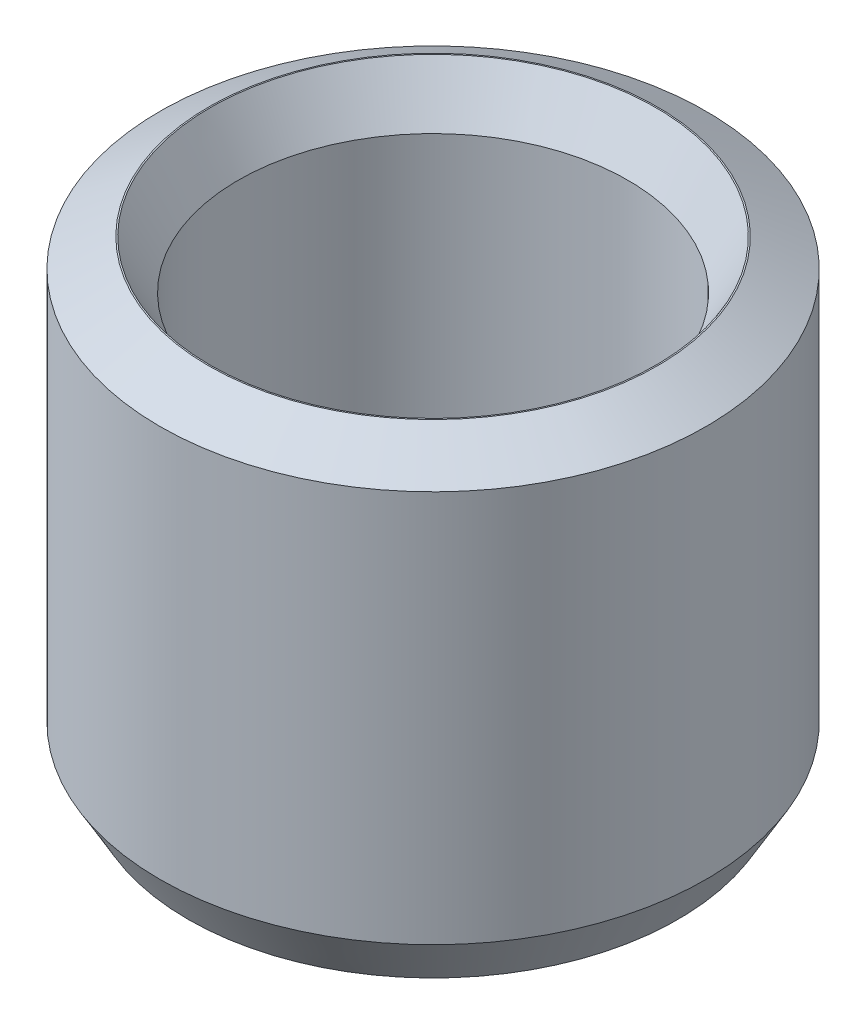
ISO-10303-21;
HEADER;
FILE_DESCRIPTION(('STEP AP214'),'2;1');
FILE_NAME('part.step','',(''),(''),'','','');
FILE_SCHEMA(('AUTOMOTIVE_DESIGN { 1 0 10303 214 1 1 1 1 }'));
ENDSEC;
DATA;
#1=APPLICATION_CONTEXT('core data for automotive mechanical design processes');
#2=APPLICATION_PROTOCOL_DEFINITION('international standard','automotive_design',2000,#1);
#3=PRODUCT_CONTEXT('',#1,'mechanical');
#4=PRODUCT('Part','Part','',(#3));
#5=PRODUCT_RELATED_PRODUCT_CATEGORY('part','',(#4));
#6=PRODUCT_DEFINITION_FORMATION('','',#4);
#7=PRODUCT_DEFINITION_CONTEXT('part definition',#1,'design');
#8=PRODUCT_DEFINITION('design','',#6,#7);
#9=PRODUCT_DEFINITION_SHAPE('','',#8);
#10=(LENGTH_UNIT() NAMED_UNIT(*) SI_UNIT(.MILLI.,.METRE.));
#11=(NAMED_UNIT(*) PLANE_ANGLE_UNIT() SI_UNIT($,.RADIAN.));
#12=(NAMED_UNIT(*) SI_UNIT($,.STERADIAN.) SOLID_ANGLE_UNIT());
#13=UNCERTAINTY_MEASURE_WITH_UNIT(LENGTH_MEASURE(1.E-05),#10,'distance_accuracy_value','');
#14=(GEOMETRIC_REPRESENTATION_CONTEXT(3) GLOBAL_UNCERTAINTY_ASSIGNED_CONTEXT((#13)) GLOBAL_UNIT_ASSIGNED_CONTEXT((#10,
#11,#12)) REPRESENTATION_CONTEXT('',''));
#15=CARTESIAN_POINT('',(0.,0.,0.));
#16=DIRECTION('',(0.,0.,1.));
#17=DIRECTION('',(1.,0.,0.));
#18=AXIS2_PLACEMENT_3D('',#15,#16,#17);
#19=CARTESIAN_POINT('',(0.,17.1783926277646,0.));
#20=DIRECTION('',(0.,-1.,0.));
#21=DIRECTION('',(0.,0.,-1.));
#22=AXIS2_PLACEMENT_3D('',#19,#20,#21);
#23=CYLINDRICAL_SURFACE('',#22,10.);
#24=CARTESIAN_POINT('',(0.,1.78422582062827,0.));
#25=DIRECTION('',(0.,1.,0.));
#26=DIRECTION('',(0.,0.,1.));
#27=AXIS2_PLACEMENT_3D('',#24,#25,#26);
#28=CIRCLE('',#27,10.);
#29=CARTESIAN_POINT('',(0.,1.78422582062827,10.));
#30=VERTEX_POINT('',#29);
#31=EDGE_CURVE('E10',#30,#30,#28,.T.);
#32=ORIENTED_EDGE('',*,*,#31,.T.);
#33=EDGE_LOOP('',(#32));
#34=FACE_BOUND('',#33,.T.);
#35=CARTESIAN_POINT('',(0.,16.1482693699298,0.));
#36=DIRECTION('',(0.,1.,0.));
#37=DIRECTION('',(0.,0.,1.));
#38=AXIS2_PLACEMENT_3D('',#35,#36,#37);
#39=CIRCLE('',#38,10.);
#40=CARTESIAN_POINT('',(0.,16.1482693699298,10.));
#41=VERTEX_POINT('',#40);
#42=EDGE_CURVE('E50',#41,#41,#39,.F.);
#43=ORIENTED_EDGE('',*,*,#42,.T.);
#44=EDGE_LOOP('',(#43));
#45=FACE_BOUND('',#44,.T.);
#46=ADVANCED_FACE('F39',(#34,#45),#23,.T.);
#47=CARTESIAN_POINT('',(0.,17.1783926277646,0.));
#48=DIRECTION('',(0.,1.,0.));
#49=DIRECTION('',(0.,0.,1.));
#50=AXIS2_PLACEMENT_3D('',#47,#48,#49);
#51=PLANE('',#50);
#52=CARTESIAN_POINT('',(0.,17.1783926277646,0.));
#53=DIRECTION('',(0.,1.,0.));
#54=DIRECTION('',(0.,0.,1.));
#55=AXIS2_PLACEMENT_3D('',#52,#53,#54);
#56=CIRCLE('',#55,8.16568415285992);
#57=CARTESIAN_POINT('',(0.,17.1783926277646,8.16568415285992));
#58=VERTEX_POINT('',#57);
#59=EDGE_CURVE('E58',#58,#58,#56,.F.);
#60=ORIENTED_EDGE('',*,*,#59,.T.);
#61=EDGE_LOOP('',(#60));
#62=FACE_BOUND('',#61,.T.);
#63=CARTESIAN_POINT('',(0.,17.1783926277646,0.));
#64=DIRECTION('',(0.,1.,0.));
#65=DIRECTION('',(0.,0.,1.));
#66=AXIS2_PLACEMENT_3D('',#63,#64,#65);
#67=CIRCLE('',#66,8.21577417937174);
#68=CARTESIAN_POINT('',(0.,17.1783926277646,8.21577417937174));
#69=VERTEX_POINT('',#68);
#70=EDGE_CURVE('E61',#69,#69,#67,.T.);
#71=ORIENTED_EDGE('',*,*,#70,.T.);
#72=EDGE_LOOP('',(#71));
#73=FACE_BOUND('',#72,.T.);
#74=ADVANCED_FACE('F88',(#62,#73),#51,.T.);
#75=CARTESIAN_POINT('',(0.,0.,0.));
#76=DIRECTION('',(0.,1.,0.));
#77=DIRECTION('',(0.,0.,1.));
#78=AXIS2_PLACEMENT_3D('',#75,#76,#77);
#79=PLANE('',#78);
#80=CARTESIAN_POINT('',(0.,0.,0.));
#81=DIRECTION('',(0.,1.,0.));
#82=DIRECTION('',(0.,0.,1.));
#83=AXIS2_PLACEMENT_3D('',#80,#81,#82);
#84=CIRCLE('',#83,8.91978671565337);
#85=CARTESIAN_POINT('',(0.,0.,8.91978671565337));
#86=VERTEX_POINT('',#85);
#87=EDGE_CURVE('E51',#86,#86,#84,.T.);
#88=ORIENTED_EDGE('',*,*,#87,.T.);
#89=EDGE_LOOP('',(#88));
#90=FACE_BOUND('',#89,.T.);
#91=CARTESIAN_POINT('',(0.,0.,0.));
#92=DIRECTION('',(0.,1.,0.));
#93=DIRECTION('',(0.,0.,1.));
#94=AXIS2_PLACEMENT_3D('',#91,#92,#93);
#95=CIRCLE('',#94,8.96987674216519);
#96=CARTESIAN_POINT('',(0.,0.,8.96987674216519));
#97=VERTEX_POINT('',#96);
#98=EDGE_CURVE('E54',#97,#97,#95,.F.);
#99=ORIENTED_EDGE('',*,*,#98,.T.);
#100=EDGE_LOOP('',(#99));
#101=FACE_BOUND('',#100,.T.);
#102=ADVANCED_FACE('F83',(#90,#101),#79,.F.);
#103=CARTESIAN_POINT('',(0.,17.1783926277646,0.));
#104=DIRECTION('',(0.,-1.,0.));
#105=DIRECTION('',(0.,0.,-1.));
#106=AXIS2_PLACEMENT_3D('',#103,#104,#105);
#107=CYLINDRICAL_SURFACE('',#106,7.1355608950251);
#108=CARTESIAN_POINT('',(0.,15.3941668071364,0.));
#109=DIRECTION('',(0.,1.,0.));
#110=DIRECTION('',(0.,0.,1.));
#111=AXIS2_PLACEMENT_3D('',#108,#109,#110);
#112=CIRCLE('',#111,7.1355608950251);
#113=CARTESIAN_POINT('',(0.,15.3941668071364,7.13556089502509));
#114=VERTEX_POINT('',#113);
#115=EDGE_CURVE('E67',#114,#114,#112,.T.);
#116=ORIENTED_EDGE('',*,*,#115,.T.);
#117=EDGE_LOOP('',(#116));
#118=FACE_BOUND('',#117,.T.);
#119=CARTESIAN_POINT('',(0.,1.03012325783482,0.));
#120=DIRECTION('',(0.,1.,0.));
#121=DIRECTION('',(0.,0.,1.));
#122=AXIS2_PLACEMENT_3D('',#119,#120,#121);
#123=CIRCLE('',#122,7.1355608950251);
#124=CARTESIAN_POINT('',(0.,1.03012325783482,7.1355608950251));
#125=VERTEX_POINT('',#124);
#126=EDGE_CURVE('E69',#125,#125,#123,.F.);
#127=ORIENTED_EDGE('',*,*,#126,.T.);
#128=EDGE_LOOP('',(#127));
#129=FACE_BOUND('',#128,.T.);
#130=ADVANCED_FACE('F71',(#118,#129),#107,.F.);
#131=CARTESIAN_POINT('',(0.,15.3941668071364,0.));
#132=DIRECTION('',(0.,1.,0.));
#133=DIRECTION('',(0.,0.,1.));
#134=AXIS2_PLACEMENT_3D('',#131,#132,#133);
#135=CONICAL_SURFACE('',#134,7.1355608950251,0.523598775598302);
#136=CARTESIAN_POINT('',(0.,17.1783926277646,8.16568415285992));
#137=CARTESIAN_POINT('',(0.,17.1598069421331,8.15495370225747));
#138=CARTESIAN_POINT('',(0.,17.1412212565016,8.14422325165502));
#139=CARTESIAN_POINT('',(0.,17.1040498852385,8.12276235045013));
#140=CARTESIAN_POINT('',(0.,17.0854641996069,8.11203189984769));
#141=CARTESIAN_POINT('',(0.,17.0482928283438,8.09057099864279));
#142=CARTESIAN_POINT('',(0.,17.0297071427123,8.07984054804035));
#143=CARTESIAN_POINT('',(0.,16.9925357714492,8.05837964683546));
#144=CARTESIAN_POINT('',(0.,16.9739500858177,8.04764919623301));
#145=CARTESIAN_POINT('',(0.,16.9367787145546,8.02618829502812));
#146=CARTESIAN_POINT('',(0.,16.918193028923,8.01545784442567));
#147=CARTESIAN_POINT('',(0.,16.8810216576599,7.99399694322078));
#148=CARTESIAN_POINT('',(0.,16.8624359720284,7.98326649261833));
#149=CARTESIAN_POINT('',(0.,16.8252646007653,7.96180559141344));
#150=CARTESIAN_POINT('',(0.,16.8066789151338,7.951075140811));
#151=CARTESIAN_POINT('',(0.,16.7695075438707,7.92961423960611));
#152=CARTESIAN_POINT('',(0.,16.7509218582391,7.91888378900366));
#153=CARTESIAN_POINT('',(0.,16.713750486976,7.89742288779877));
#154=CARTESIAN_POINT('',(0.,16.6951648013445,7.88669243719632));
#155=CARTESIAN_POINT('',(0.,16.6579934300814,7.86523153599143));
#156=CARTESIAN_POINT('',(0.,16.6394077444499,7.85450108538898));
#157=CARTESIAN_POINT('',(0.,16.6022363731868,7.83304018418409));
#158=CARTESIAN_POINT('',(0.,16.5836506875552,7.82230973358164));
#159=CARTESIAN_POINT('',(0.,16.5464793162921,7.80084883237675));
#160=CARTESIAN_POINT('',(0.,16.5278936306606,7.7901183817743));
#161=CARTESIAN_POINT('',(0.,16.4907222593975,7.76865748056941));
#162=CARTESIAN_POINT('',(0.,16.472136573766,7.75792702996697));
#163=CARTESIAN_POINT('',(0.,16.4349652025029,7.73646612876208));
#164=CARTESIAN_POINT('',(0.,16.4163795168713,7.72573567815963));
#165=CARTESIAN_POINT('',(0.,16.3792081456082,7.70427477695474));
#166=CARTESIAN_POINT('',(0.,16.3606224599767,7.69354432635229));
#167=CARTESIAN_POINT('',(0.,16.3234510887136,7.6720834251474));
#168=CARTESIAN_POINT('',(0.,16.3048654030821,7.66135297454495));
#169=CARTESIAN_POINT('',(0.,16.267694031819,7.63989207334006));
#170=CARTESIAN_POINT('',(0.,16.2491083461874,7.62916162273762));
#171=CARTESIAN_POINT('',(0.,16.2119369749243,7.60770072153272));
#172=CARTESIAN_POINT('',(0.,16.1933512892928,7.59697027093028));
#173=CARTESIAN_POINT('',(0.,16.1561799180297,7.57550936972538));
#174=CARTESIAN_POINT('',(0.,16.1375942323982,7.56477891912294));
#175=CARTESIAN_POINT('',(0.,16.1004228611351,7.54331801791805));
#176=CARTESIAN_POINT('',(0.,16.0818371755035,7.5325875673156));
#177=CARTESIAN_POINT('',(0.,16.0446658042404,7.51112666611071));
#178=CARTESIAN_POINT('',(0.,16.0260801186089,7.50039621550826));
#179=CARTESIAN_POINT('',(0.,15.9889087473458,7.47893531430337));
#180=CARTESIAN_POINT('',(0.,15.9703230617143,7.46820486370092));
#181=CARTESIAN_POINT('',(0.,15.9331516904512,7.44674396249603));
#182=CARTESIAN_POINT('',(0.,15.9145660048196,7.43601351189358));
#183=CARTESIAN_POINT('',(0.,15.8773946335565,7.41455261068869));
#184=CARTESIAN_POINT('',(0.,15.858808947925,7.40382216008625));
#185=CARTESIAN_POINT('',(0.,15.8216375766619,7.38236125888135));
#186=CARTESIAN_POINT('',(0.,15.8030518910303,7.37163080827891));
#187=CARTESIAN_POINT('',(0.,15.7658805197673,7.35016990707402));
#188=CARTESIAN_POINT('',(0.,15.7472948341357,7.33943945647157));
#189=CARTESIAN_POINT('',(0.,15.7101234628726,7.31797855526668));
#190=CARTESIAN_POINT('',(0.,15.6915377772411,7.30724810466423));
#191=CARTESIAN_POINT('',(0.,15.654366405978,7.28578720345934));
#192=CARTESIAN_POINT('',(0.,15.6357807203464,7.27505675285689));
#193=CARTESIAN_POINT('',(0.,15.5986093490834,7.253595851652));
#194=CARTESIAN_POINT('',(0.,15.5800236634518,7.24286540104956));
#195=CARTESIAN_POINT('',(0.,15.5428522921887,7.22140449984466));
#196=CARTESIAN_POINT('',(0.,15.5242666065572,7.21067404924222));
#197=CARTESIAN_POINT('',(0.,15.4870952352941,7.18921314803733));
#198=CARTESIAN_POINT('',(0.,15.4685095496625,7.17848269743488));
#199=CARTESIAN_POINT('',(0.,15.4313381783995,7.15702179622999));
#200=CARTESIAN_POINT('',(0.,15.4127524927679,7.14629134562754));
#201=CARTESIAN_POINT('',(0.,15.3941668071364,7.13556089502509));
#202=B_SPLINE_CURVE_WITH_KNOTS('',3,(#136,#137,#138,#139,#140,#141,#142,#143,#144,#145,#146,
#147,#148,#149,#150,#151,#152,#153,#154,#155,#156,#157,#158,#159,#160,#161,#162,#163,#164,#165,
#166,#167,#168,#169,#170,#171,#172,#173,#174,#175,#176,#177,#178,#179,#180,#181,#182,#183,#184,
#185,#186,#187,#188,#189,#190,#191,#192,#193,#194,#195,#196,#197,#198,#199,#200,#201),
.UNSPECIFIED.,.F.,.F.,(4,2,2,2,2,2,2,2,2,2,2,2,2,2,2,2,2,2,2,2,2,2,2,2,2,2,2,2,2,2,2,2,4),(0.,
0.0643827036146747,0.128765407229352,0.193148110844026,0.257530814458703,0.32191351807338,
0.386296221688055,0.450678925302732,0.515061628917409,0.579444332532083,0.64382703614676,
0.708209739761438,0.772592443376112,0.836975146990789,0.901357850605463,0.965740554220141,
1.03012325783482,1.09450596144949,1.15888866506417,1.22327136867885,1.28765407229352,
1.3520367759082,1.41641947952287,1.48080218313755,1.54518488675223,1.6095675903669,
1.67395029398158,1.73833299759625,1.80271570121093,1.86709840482561,1.93148110844028,
1.99586381205496,2.06024651566963),.UNSPECIFIED.);
#203=EDGE_CURVE('BSEAM77',#58,#114,#202,.T.);
#204=ORIENTED_EDGE('',*,*,#59,.F.);
#205=ORIENTED_EDGE('',*,*,#115,.F.);
#206=ORIENTED_EDGE('',*,*,#203,.T.);
#207=ORIENTED_EDGE('',*,*,#203,.F.);
#208=EDGE_LOOP('',(#204,#206,#205,#207));
#209=FACE_BOUND('',#208,.T.);
#210=ADVANCED_FACE('F77',(#209),#135,.F.);
#211=CARTESIAN_POINT('',(0.,0.,0.));
#212=DIRECTION('',(0.,-1.,0.));
#213=DIRECTION('',(0.,0.,-1.));
#214=AXIS2_PLACEMENT_3D('',#211,#212,#213);
#215=CONICAL_SURFACE('',#214,8.91978671565337,1.04719755119659);
#216=ORIENTED_EDGE('',*,*,#126,.F.);
#217=EDGE_LOOP('',(#216));
#218=FACE_BOUND('',#217,.T.);
#219=ORIENTED_EDGE('',*,*,#87,.F.);
#220=EDGE_LOOP('',(#219));
#221=FACE_BOUND('',#220,.T.);
#222=ADVANCED_FACE('F73',(#218,#221),#215,.F.);
#223=CARTESIAN_POINT('',(0.,1.78422582062827,0.));
#224=DIRECTION('',(0.,1.,0.));
#225=DIRECTION('',(0.,0.,1.));
#226=AXIS2_PLACEMENT_3D('',#223,#224,#225);
#227=CONICAL_SURFACE('',#226,10.,0.523598775598301);
#228=CARTESIAN_POINT('',(0.,0.,8.96987674216519));
#229=CARTESIAN_POINT('',(0.,0.0185856856315441,8.98060719276763));
#230=CARTESIAN_POINT('',(0.,0.0371713712630886,8.99133764337008));
#231=CARTESIAN_POINT('',(0.,0.0743427425261777,9.01279854457497));
#232=CARTESIAN_POINT('',(0.,0.0929284281577222,9.02352899517741));
#233=CARTESIAN_POINT('',(0.,0.130099799420811,9.04498989638231));
#234=CARTESIAN_POINT('',(0.,0.148685485052355,9.05572034698475));
#235=CARTESIAN_POINT('',(0.,0.185856856315444,9.07718124818965));
#236=CARTESIAN_POINT('',(0.,0.204442541946989,9.08791169879209));
#237=CARTESIAN_POINT('',(0.,0.241613913210078,9.10937259999698));
#238=CARTESIAN_POINT('',(0.,0.260199598841622,9.12010305059943));
#239=CARTESIAN_POINT('',(0.,0.297370970104711,9.14156395180432));
#240=CARTESIAN_POINT('',(0.,0.315956655736256,9.15229440240677));
#241=CARTESIAN_POINT('',(0.,0.353128026999344,9.17375530361166));
#242=CARTESIAN_POINT('',(0.,0.371713712630889,9.1844857542141));
#243=CARTESIAN_POINT('',(0.,0.408885083893977,9.205946655419));
#244=CARTESIAN_POINT('',(0.,0.427470769525522,9.21667710602144));
#245=CARTESIAN_POINT('',(0.,0.464642140788611,9.23813800722634));
#246=CARTESIAN_POINT('',(0.,0.483227826420156,9.24886845782878));
#247=CARTESIAN_POINT('',(0.,0.520399197683244,9.27032935903367));
#248=CARTESIAN_POINT('',(0.,0.538984883314789,9.28105980963612));
#249=CARTESIAN_POINT('',(0.,0.576156254577878,9.30252071084101));
#250=CARTESIAN_POINT('',(0.,0.594741940209422,9.31325116144346));
#251=CARTESIAN_POINT('',(0.,0.631913311472511,9.33471206264835));
#252=CARTESIAN_POINT('',(0.,0.650498997104056,9.3454425132508));
#253=CARTESIAN_POINT('',(0.,0.687670368367144,9.36690341445569));
#254=CARTESIAN_POINT('',(0.,0.706256053998689,9.37763386505813));
#255=CARTESIAN_POINT('',(0.,0.743427425261778,9.39909476626303));
#256=CARTESIAN_POINT('',(0.,0.762013110893322,9.40982521686547));
#257=CARTESIAN_POINT('',(0.,0.799184482156411,9.43128611807036));
#258=CARTESIAN_POINT('',(0.,0.817770167787955,9.44201656867281));
#259=CARTESIAN_POINT('',(0.,0.854941539051044,9.4634774698777));
#260=CARTESIAN_POINT('',(0.,0.873527224682589,9.47420792048015));
#261=CARTESIAN_POINT('',(0.,0.910698595945678,9.49566882168504));
#262=CARTESIAN_POINT('',(0.,0.929284281577222,9.50639927228749));
#263=CARTESIAN_POINT('',(0.,0.966455652840311,9.52786017349238));
#264=CARTESIAN_POINT('',(0.,0.985041338471856,9.53859062409482));
#265=CARTESIAN_POINT('',(0.,1.02221270973494,9.56005152529971));
#266=CARTESIAN_POINT('',(0.,1.04079839536649,9.57078197590216));
#267=CARTESIAN_POINT('',(0.,1.07796976662958,9.59224287710705));
#268=CARTESIAN_POINT('',(0.,1.09655545226112,9.6029733277095));
#269=CARTESIAN_POINT('',(0.,1.13372682352421,9.62443422891439));
#270=CARTESIAN_POINT('',(0.,1.15231250915576,9.63516467951684));
#271=CARTESIAN_POINT('',(0.,1.18948388041884,9.65662558072173));
#272=CARTESIAN_POINT('',(0.,1.20806956605039,9.66735603132418));
#273=CARTESIAN_POINT('',(0.,1.24524093731348,9.68881693252907));
#274=CARTESIAN_POINT('',(0.,1.26382662294502,9.69954738313151));
#275=CARTESIAN_POINT('',(0.,1.30099799420811,9.72100828433641));
#276=CARTESIAN_POINT('',(0.,1.31958367983966,9.73173873493885));
#277=CARTESIAN_POINT('',(0.,1.35675505110274,9.75319963614374));
#278=CARTESIAN_POINT('',(0.,1.37534073673429,9.76393008674619));
#279=CARTESIAN_POINT('',(0.,1.41251210799738,9.78539098795108));
#280=CARTESIAN_POINT('',(0.,1.43109779362892,9.79612143855353));
#281=CARTESIAN_POINT('',(0.,1.46826916489201,9.81758233975842));
#282=CARTESIAN_POINT('',(0.,1.48685485052356,9.82831279036087));
#283=CARTESIAN_POINT('',(0.,1.52402622178664,9.84977369156576));
#284=CARTESIAN_POINT('',(0.,1.54261190741819,9.8605041421682));
#285=CARTESIAN_POINT('',(0.,1.57978327868128,9.8819650433731));
#286=CARTESIAN_POINT('',(0.,1.59836896431282,9.89269549397554));
#287=CARTESIAN_POINT('',(0.,1.63554033557591,9.91415639518043));
#288=CARTESIAN_POINT('',(0.,1.65412602120746,9.92488684578288));
#289=CARTESIAN_POINT('',(0.,1.69129739247054,9.94634774698777));
#290=CARTESIAN_POINT('',(0.,1.70988307810209,9.95707819759022));
#291=CARTESIAN_POINT('',(0.,1.74705444936518,9.97853909879511));
#292=CARTESIAN_POINT('',(0.,1.76564013499672,9.98926954939756));
#293=CARTESIAN_POINT('',(0.,1.78422582062827,10.));
#294=B_SPLINE_CURVE_WITH_KNOTS('',3,(#228,#229,#230,#231,#232,#233,#234,#235,#236,#237,#238,
#239,#240,#241,#242,#243,#244,#245,#246,#247,#248,#249,#250,#251,#252,#253,#254,#255,#256,#257,
#258,#259,#260,#261,#262,#263,#264,#265,#266,#267,#268,#269,#270,#271,#272,#273,#274,#275,#276,
#277,#278,#279,#280,#281,#282,#283,#284,#285,#286,#287,#288,#289,#290,#291,#292,#293),
.UNSPECIFIED.,.F.,.F.,(4,2,2,2,2,2,2,2,2,2,2,2,2,2,2,2,2,2,2,2,2,2,2,2,2,2,2,2,2,2,2,2,4),(0.,
0.0643827036146756,0.128765407229351,0.193148110844028,0.257530814458703,0.321913518073379,
0.386296221688054,0.450678925302731,0.515061628917406,0.579444332532082,0.643827036146757,
0.708209739761434,0.772592443376109,0.836975146990785,0.90135785060546,0.965740554220137,
1.03012325783481,1.09450596144949,1.15888866506416,1.22327136867884,1.28765407229352,
1.35203677590819,1.41641947952287,1.48080218313754,1.54518488675222,1.60956759036689,
1.67395029398157,1.73833299759625,1.80271570121092,1.8670984048256,1.93148110844027,
1.99586381205495,2.06024651566963),.UNSPECIFIED.);
#295=EDGE_CURVE('BSEAM76',#97,#30,#294,.T.);
#296=ORIENTED_EDGE('',*,*,#98,.F.);
#297=ORIENTED_EDGE('',*,*,#31,.F.);
#298=ORIENTED_EDGE('',*,*,#295,.T.);
#299=ORIENTED_EDGE('',*,*,#295,.F.);
#300=EDGE_LOOP('',(#296,#298,#297,#299));
#301=FACE_BOUND('',#300,.T.);
#302=ADVANCED_FACE('F76',(#301),#227,.T.);
#303=CARTESIAN_POINT('',(0.,17.1783926277646,0.));
#304=DIRECTION('',(0.,-1.,0.));
#305=DIRECTION('',(0.,0.,-1.));
#306=AXIS2_PLACEMENT_3D('',#303,#304,#305);
#307=CONICAL_SURFACE('',#306,8.21577417937174,1.0471975511966);
#308=ORIENTED_EDGE('',*,*,#42,.F.);
#309=EDGE_LOOP('',(#308));
#310=FACE_BOUND('',#309,.T.);
#311=ORIENTED_EDGE('',*,*,#70,.F.);
#312=EDGE_LOOP('',(#311));
#313=FACE_BOUND('',#312,.T.);
#314=ADVANCED_FACE('F45',(#310,#313),#307,.T.);
#315=CLOSED_SHELL('',(#46,#74,#102,#130,#210,#222,#302,#314));
#316=MANIFOLD_SOLID_BREP('B2',#315);
#317=ADVANCED_BREP_SHAPE_REPRESENTATION('',(#18,#316),#14);
#318=SHAPE_DEFINITION_REPRESENTATION(#9,#317);
ENDSEC;
END-ISO-10303-21;
